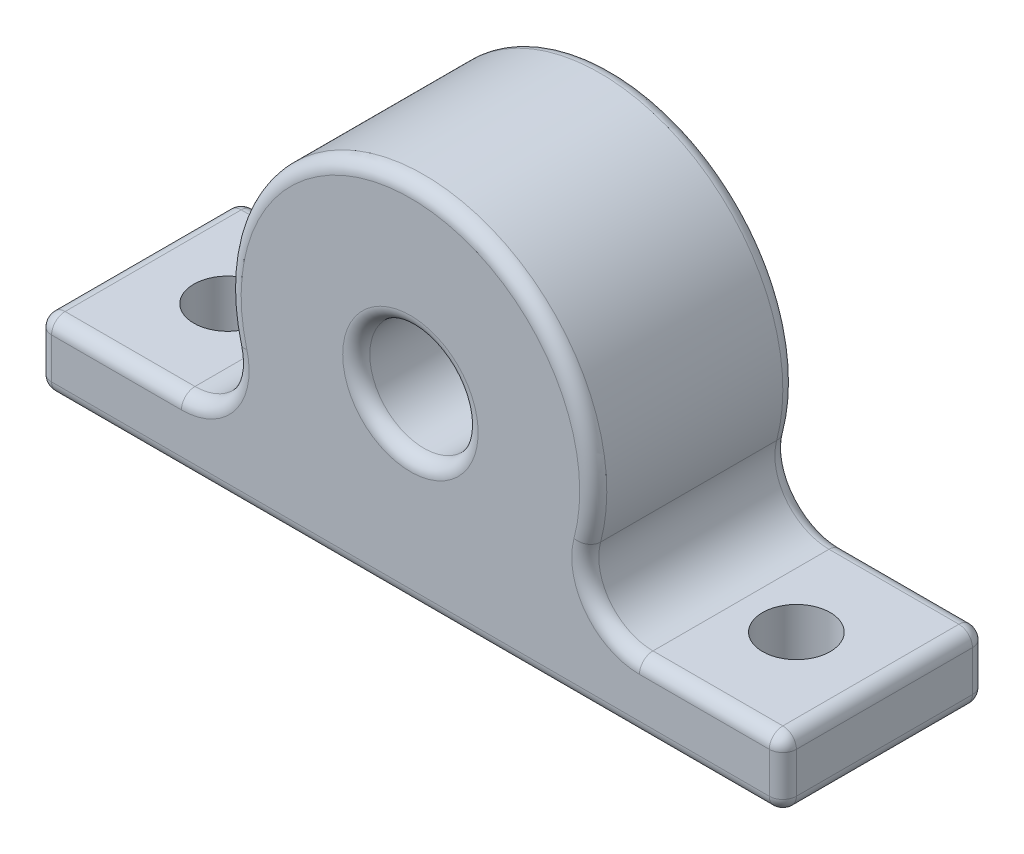
ISO-10303-21;
HEADER;
FILE_DESCRIPTION(('STEP AP214'),'2;1');
FILE_NAME('part.step','',(''),(''),'','','');
FILE_SCHEMA(('AUTOMOTIVE_DESIGN { 1 0 10303 214 1 1 1 1 }'));
ENDSEC;
DATA;
#1=APPLICATION_CONTEXT('core data for automotive mechanical design processes');
#2=APPLICATION_PROTOCOL_DEFINITION('international standard','automotive_design',2000,#1);
#3=PRODUCT_CONTEXT('',#1,'mechanical');
#4=PRODUCT('Part','Part','',(#3));
#5=PRODUCT_RELATED_PRODUCT_CATEGORY('part','',(#4));
#6=PRODUCT_DEFINITION_FORMATION('','',#4);
#7=PRODUCT_DEFINITION_CONTEXT('part definition',#1,'design');
#8=PRODUCT_DEFINITION('design','',#6,#7);
#9=PRODUCT_DEFINITION_SHAPE('','',#8);
#10=(LENGTH_UNIT() NAMED_UNIT(*) SI_UNIT(.MILLI.,.METRE.));
#11=(NAMED_UNIT(*) PLANE_ANGLE_UNIT() SI_UNIT($,.RADIAN.));
#12=(NAMED_UNIT(*) SI_UNIT($,.STERADIAN.) SOLID_ANGLE_UNIT());
#13=UNCERTAINTY_MEASURE_WITH_UNIT(LENGTH_MEASURE(1.E-05),#10,'distance_accuracy_value','');
#14=(GEOMETRIC_REPRESENTATION_CONTEXT(3) GLOBAL_UNCERTAINTY_ASSIGNED_CONTEXT((#13)) GLOBAL_UNIT_ASSIGNED_CONTEXT((#10,
#11,#12)) REPRESENTATION_CONTEXT('',''));
#15=CARTESIAN_POINT('',(0.,0.,0.));
#16=DIRECTION('',(0.,0.,1.));
#17=DIRECTION('',(1.,0.,0.));
#18=AXIS2_PLACEMENT_3D('',#15,#16,#17);
#19=CARTESIAN_POINT('',(0.,5.,0.));
#20=DIRECTION('',(0.,1.,0.));
#21=DIRECTION('',(0.,0.,1.));
#22=AXIS2_PLACEMENT_3D('',#19,#20,#21);
#23=PLANE('',#22);
#24=CARTESIAN_POINT('',(21.,5.,0.));
#25=DIRECTION('',(0.,1.,0.));
#26=DIRECTION('',(0.,0.,1.));
#27=AXIS2_PLACEMENT_3D('',#24,#25,#26);
#28=CIRCLE('',#27,2.5);
#29=CARTESIAN_POINT('',(21.,5.,2.5));
#30=VERTEX_POINT('',#29);
#31=EDGE_CURVE('E309',#30,#30,#28,.F.);
#32=ORIENTED_EDGE('',*,*,#31,.T.);
#33=EDGE_LOOP('',(#32));
#34=FACE_BOUND('',#33,.T.);
#35=DIRECTION('',(0.,0.,-1.));
#36=VECTOR('',#35,1.);
#37=CARTESIAN_POINT('',(26.5,5.,-7.5));
#38=LINE('',#37,#36);
#39=CARTESIAN_POINT('',(26.5,5.,6.5));
#40=VERTEX_POINT('',#39);
#41=CARTESIAN_POINT('',(26.5,5.,-6.5));
#42=VERTEX_POINT('',#41);
#43=EDGE_CURVE('E178',#40,#42,#38,.T.);
#44=ORIENTED_EDGE('',*,*,#43,.T.);
#45=DIRECTION('',(-1.,0.,0.));
#46=VECTOR('',#45,1.);
#47=CARTESIAN_POINT('',(16.9115345252878,5.,-6.5));
#48=LINE('',#47,#46);
#49=CARTESIAN_POINT('',(16.9115345252878,5.,-6.5));
#50=VERTEX_POINT('',#49);
#51=EDGE_CURVE('E173',#42,#50,#48,.T.);
#52=ORIENTED_EDGE('',*,*,#51,.T.);
#53=DIRECTION('',(0.,0.,-1.));
#54=VECTOR('',#53,1.);
#55=CARTESIAN_POINT('',(16.9115345252878,5.,0.));
#56=LINE('',#55,#54);
#57=CARTESIAN_POINT('',(16.9115345252878,5.,6.5));
#58=VERTEX_POINT('',#57);
#59=EDGE_CURVE('E175',#50,#58,#56,.F.);
#60=ORIENTED_EDGE('',*,*,#59,.T.);
#61=DIRECTION('',(1.,0.,0.));
#62=VECTOR('',#61,1.);
#63=CARTESIAN_POINT('',(27.5,5.,6.5));
#64=LINE('',#63,#62);
#65=EDGE_CURVE('E437',#58,#40,#64,.T.);
#66=ORIENTED_EDGE('',*,*,#65,.T.);
#67=EDGE_LOOP('',(#44,#52,#60,#66));
#68=FACE_BOUND('',#67,.T.);
#69=ADVANCED_FACE('F33',(#34,#68),#23,.T.);
#70=CARTESIAN_POINT('',(-21.,5.,0.));
#71=DIRECTION('',(0.,1.,0.));
#72=DIRECTION('',(0.,0.,1.));
#73=AXIS2_PLACEMENT_3D('',#70,#71,#72);
#74=CIRCLE('',#73,2.5);
#75=CARTESIAN_POINT('',(-21.,5.,2.5));
#76=VERTEX_POINT('',#75);
#77=EDGE_CURVE('E633',#76,#76,#74,.F.);
#78=ORIENTED_EDGE('',*,*,#77,.T.);
#79=EDGE_LOOP('',(#78));
#80=FACE_BOUND('',#79,.T.);
#81=DIRECTION('',(0.,0.,-1.));
#82=VECTOR('',#81,1.);
#83=CARTESIAN_POINT('',(-16.9115345252878,5.,0.));
#84=LINE('',#83,#82);
#85=CARTESIAN_POINT('',(-16.9115345252878,5.,6.5));
#86=VERTEX_POINT('',#85);
#87=CARTESIAN_POINT('',(-16.9115345252878,5.,-6.5));
#88=VERTEX_POINT('',#87);
#89=EDGE_CURVE('E427',#86,#88,#84,.T.);
#90=ORIENTED_EDGE('',*,*,#89,.T.);
#91=DIRECTION('',(-1.,0.,0.));
#92=VECTOR('',#91,1.);
#93=CARTESIAN_POINT('',(-27.5,5.,-6.5));
#94=LINE('',#93,#92);
#95=CARTESIAN_POINT('',(-26.5,5.,-6.5));
#96=VERTEX_POINT('',#95);
#97=EDGE_CURVE('E360',#88,#96,#94,.T.);
#98=ORIENTED_EDGE('',*,*,#97,.T.);
#99=DIRECTION('',(0.,0.,1.));
#100=VECTOR('',#99,1.);
#101=CARTESIAN_POINT('',(-26.5,5.,7.5));
#102=LINE('',#101,#100);
#103=CARTESIAN_POINT('',(-26.5,5.,6.5));
#104=VERTEX_POINT('',#103);
#105=EDGE_CURVE('E358',#96,#104,#102,.T.);
#106=ORIENTED_EDGE('',*,*,#105,.T.);
#107=DIRECTION('',(1.,0.,0.));
#108=VECTOR('',#107,1.);
#109=CARTESIAN_POINT('',(-16.9115345252878,5.,6.5));
#110=LINE('',#109,#108);
#111=EDGE_CURVE('E356',#104,#86,#110,.T.);
#112=ORIENTED_EDGE('',*,*,#111,.T.);
#113=EDGE_LOOP('',(#90,#98,#106,#112));
#114=FACE_BOUND('',#113,.T.);
#115=ADVANCED_FACE('F463',(#80,#114),#23,.T.);
#116=CARTESIAN_POINT('',(27.5,5.,-7.5));
#117=DIRECTION('',(-1.,0.,0.));
#118=DIRECTION('',(0.,0.,1.));
#119=AXIS2_PLACEMENT_3D('',#116,#117,#118);
#120=PLANE('',#119);
#121=DIRECTION('',(0.,0.,-1.));
#122=VECTOR('',#121,1.);
#123=CARTESIAN_POINT('',(27.5,1.,-7.5));
#124=LINE('',#123,#122);
#125=CARTESIAN_POINT('',(27.5,1.,6.5));
#126=VERTEX_POINT('',#125);
#127=CARTESIAN_POINT('',(27.5,1.,-6.5));
#128=VERTEX_POINT('',#127);
#129=EDGE_CURVE('E333',#126,#128,#124,.T.);
#130=ORIENTED_EDGE('',*,*,#129,.T.);
#131=DIRECTION('',(0.,-1.,0.));
#132=VECTOR('',#131,1.);
#133=CARTESIAN_POINT('',(27.5,5.,-6.5));
#134=LINE('',#133,#132);
#135=CARTESIAN_POINT('',(27.5,4.,-6.5));
#136=VERTEX_POINT('',#135);
#137=EDGE_CURVE('E339',#128,#136,#134,.F.);
#138=ORIENTED_EDGE('',*,*,#137,.T.);
#139=DIRECTION('',(0.,0.,-1.));
#140=VECTOR('',#139,1.);
#141=CARTESIAN_POINT('',(27.5,4.,7.5));
#142=LINE('',#141,#140);
#143=CARTESIAN_POINT('',(27.5,4.,6.5));
#144=VERTEX_POINT('',#143);
#145=EDGE_CURVE('E336',#136,#144,#142,.F.);
#146=ORIENTED_EDGE('',*,*,#145,.T.);
#147=DIRECTION('',(0.,-1.,0.));
#148=VECTOR('',#147,1.);
#149=CARTESIAN_POINT('',(27.5,5.,6.5));
#150=LINE('',#149,#148);
#151=EDGE_CURVE('E182',#144,#126,#150,.T.);
#152=ORIENTED_EDGE('',*,*,#151,.T.);
#153=EDGE_LOOP('',(#130,#138,#146,#152));
#154=FACE_BOUND('',#153,.T.);
#155=ADVANCED_FACE('F337',(#154),#120,.F.);
#156=CARTESIAN_POINT('',(-27.5,5.,-7.5));
#157=DIRECTION('',(0.,0.,1.));
#158=DIRECTION('',(1.,0.,0.));
#159=AXIS2_PLACEMENT_3D('',#156,#157,#158);
#160=PLANE('',#159);
#161=CARTESIAN_POINT('',(0.,13.5,-7.5));
#162=DIRECTION('',(0.,0.,1.));
#163=DIRECTION('',(1.,0.,0.));
#164=AXIS2_PLACEMENT_3D('',#161,#162,#163);
#165=CIRCLE('',#164,5.);
#166=CARTESIAN_POINT('',(5.,13.5,-7.5));
#167=VERTEX_POINT('',#166);
#168=EDGE_CURVE('E392',#167,#167,#165,.T.);
#169=ORIENTED_EDGE('',*,*,#168,.T.);
#170=EDGE_LOOP('',(#169));
#171=FACE_BOUND('',#170,.T.);
#172=DIRECTION('',(-1.,0.,0.));
#173=VECTOR('',#172,1.);
#174=CARTESIAN_POINT('',(-27.5,1.,-7.5));
#175=LINE('',#174,#173);
#176=CARTESIAN_POINT('',(26.5,1.,-7.5));
#177=VERTEX_POINT('',#176);
#178=CARTESIAN_POINT('',(-26.5,1.,-7.5));
#179=VERTEX_POINT('',#178);
#180=EDGE_CURVE('E387',#177,#179,#175,.T.);
#181=ORIENTED_EDGE('',*,*,#180,.T.);
#182=DIRECTION('',(0.,-1.,0.));
#183=VECTOR('',#182,1.);
#184=CARTESIAN_POINT('',(-26.5,5.,-7.5));
#185=LINE('',#184,#183);
#186=CARTESIAN_POINT('',(-26.5,4.,-7.5));
#187=VERTEX_POINT('',#186);
#188=EDGE_CURVE('E389',#179,#187,#185,.F.);
#189=ORIENTED_EDGE('',*,*,#188,.T.);
#190=DIRECTION('',(-1.,0.,0.));
#191=VECTOR('',#190,1.);
#192=CARTESIAN_POINT('',(-16.9115345252878,4.,-7.5));
#193=LINE('',#192,#191);
#194=CARTESIAN_POINT('',(-16.9115345252878,4.,-7.5));
#195=VERTEX_POINT('',#194);
#196=EDGE_CURVE('E376',#187,#195,#193,.F.);
#197=ORIENTED_EDGE('',*,*,#196,.T.);
#198=CARTESIAN_POINT('',(-16.9115345252878,9.,-7.5));
#199=DIRECTION('',(0.,0.,1.));
#200=DIRECTION('',(1.,0.,0.));
#201=AXIS2_PLACEMENT_3D('',#198,#199,#200);
#202=CIRCLE('',#201,5.);
#203=CARTESIAN_POINT('',(-12.0796675180627,10.2857142857143,-7.5));
#204=VERTEX_POINT('',#203);
#205=EDGE_CURVE('E378',#195,#204,#202,.T.);
#206=ORIENTED_EDGE('',*,*,#205,.T.);
#207=CARTESIAN_POINT('',(0.,13.5,-7.5));
#208=DIRECTION('',(0.,0.,1.));
#209=DIRECTION('',(1.,0.,0.));
#210=AXIS2_PLACEMENT_3D('',#207,#208,#209);
#211=CIRCLE('',#210,12.5);
#212=CARTESIAN_POINT('',(12.0796675180627,10.2857142857143,-7.5));
#213=VERTEX_POINT('',#212);
#214=EDGE_CURVE('E380',#204,#213,#211,.F.);
#215=ORIENTED_EDGE('',*,*,#214,.T.);
#216=CARTESIAN_POINT('',(16.9115345252878,9.,-7.5));
#217=DIRECTION('',(0.,0.,1.));
#218=DIRECTION('',(1.,0.,0.));
#219=AXIS2_PLACEMENT_3D('',#216,#217,#218);
#220=CIRCLE('',#219,5.);
#221=CARTESIAN_POINT('',(16.9115345252878,4.,-7.5));
#222=VERTEX_POINT('',#221);
#223=EDGE_CURVE('E382',#213,#222,#220,.T.);
#224=ORIENTED_EDGE('',*,*,#223,.T.);
#225=DIRECTION('',(-1.,0.,0.));
#226=VECTOR('',#225,1.);
#227=CARTESIAN_POINT('',(27.5,4.,-7.5));
#228=LINE('',#227,#226);
#229=CARTESIAN_POINT('',(26.5,4.,-7.5));
#230=VERTEX_POINT('',#229);
#231=EDGE_CURVE('E206',#222,#230,#228,.F.);
#232=ORIENTED_EDGE('',*,*,#231,.T.);
#233=DIRECTION('',(0.,-1.,0.));
#234=VECTOR('',#233,1.);
#235=CARTESIAN_POINT('',(26.5,5.,-7.5));
#236=LINE('',#235,#234);
#237=EDGE_CURVE('E385',#230,#177,#236,.T.);
#238=ORIENTED_EDGE('',*,*,#237,.T.);
#239=EDGE_LOOP('',(#181,#189,#197,#206,#215,#224,#232,#238));
#240=FACE_BOUND('',#239,.T.);
#241=ADVANCED_FACE('F485',(#171,#240),#160,.F.);
#242=CARTESIAN_POINT('',(-27.5,5.,-7.5));
#243=DIRECTION('',(1.,0.,0.));
#244=DIRECTION('',(0.,0.,-1.));
#245=AXIS2_PLACEMENT_3D('',#242,#243,#244);
#246=PLANE('',#245);
#247=DIRECTION('',(0.,0.,1.));
#248=VECTOR('',#247,1.);
#249=CARTESIAN_POINT('',(-27.5,4.,-7.5));
#250=LINE('',#249,#248);
#251=CARTESIAN_POINT('',(-27.5,4.,6.5));
#252=VERTEX_POINT('',#251);
#253=CARTESIAN_POINT('',(-27.5,4.,-6.5));
#254=VERTEX_POINT('',#253);
#255=EDGE_CURVE('E365',#252,#254,#250,.F.);
#256=ORIENTED_EDGE('',*,*,#255,.T.);
#257=DIRECTION('',(0.,-1.,0.));
#258=VECTOR('',#257,1.);
#259=CARTESIAN_POINT('',(-27.5,5.,-6.5));
#260=LINE('',#259,#258);
#261=CARTESIAN_POINT('',(-27.5,1.,-6.5));
#262=VERTEX_POINT('',#261);
#263=EDGE_CURVE('E368',#254,#262,#260,.T.);
#264=ORIENTED_EDGE('',*,*,#263,.T.);
#265=DIRECTION('',(0.,0.,1.));
#266=VECTOR('',#265,1.);
#267=CARTESIAN_POINT('',(-27.5,1.,-7.5));
#268=LINE('',#267,#266);
#269=CARTESIAN_POINT('',(-27.5,1.,6.5));
#270=VERTEX_POINT('',#269);
#271=EDGE_CURVE('E363',#262,#270,#268,.T.);
#272=ORIENTED_EDGE('',*,*,#271,.T.);
#273=DIRECTION('',(0.,-1.,0.));
#274=VECTOR('',#273,1.);
#275=CARTESIAN_POINT('',(-27.5,5.,6.5));
#276=LINE('',#275,#274);
#277=EDGE_CURVE('E295',#270,#252,#276,.F.);
#278=ORIENTED_EDGE('',*,*,#277,.T.);
#279=EDGE_LOOP('',(#256,#264,#272,#278));
#280=FACE_BOUND('',#279,.T.);
#281=ADVANCED_FACE('F481',(#280),#246,.F.);
#282=CARTESIAN_POINT('',(-27.5,5.,7.5));
#283=DIRECTION('',(0.,0.,-1.));
#284=DIRECTION('',(-1.,0.,0.));
#285=AXIS2_PLACEMENT_3D('',#282,#283,#284);
#286=PLANE('',#285);
#287=CARTESIAN_POINT('',(0.,13.5,7.5));
#288=DIRECTION('',(0.,0.,-1.));
#289=DIRECTION('',(-1.,0.,0.));
#290=AXIS2_PLACEMENT_3D('',#287,#288,#289);
#291=CIRCLE('',#290,5.);
#292=CARTESIAN_POINT('',(-5.,13.5,7.5));
#293=VERTEX_POINT('',#292);
#294=EDGE_CURVE('E11',#293,#293,#291,.T.);
#295=ORIENTED_EDGE('',*,*,#294,.T.);
#296=EDGE_LOOP('',(#295));
#297=FACE_BOUND('',#296,.T.);
#298=DIRECTION('',(1.,0.,0.));
#299=VECTOR('',#298,1.);
#300=CARTESIAN_POINT('',(-27.5,1.,7.5));
#301=LINE('',#300,#299);
#302=CARTESIAN_POINT('',(-26.5,1.,7.5));
#303=VERTEX_POINT('',#302);
#304=CARTESIAN_POINT('',(26.5,1.,7.5));
#305=VERTEX_POINT('',#304);
#306=EDGE_CURVE('E50',#303,#305,#301,.T.);
#307=ORIENTED_EDGE('',*,*,#306,.T.);
#308=DIRECTION('',(0.,-1.,0.));
#309=VECTOR('',#308,1.);
#310=CARTESIAN_POINT('',(26.5,5.,7.5));
#311=LINE('',#310,#309);
#312=CARTESIAN_POINT('',(26.5,4.,7.5));
#313=VERTEX_POINT('',#312);
#314=EDGE_CURVE('E42',#305,#313,#311,.F.);
#315=ORIENTED_EDGE('',*,*,#314,.T.);
#316=DIRECTION('',(1.,0.,0.));
#317=VECTOR('',#316,1.);
#318=CARTESIAN_POINT('',(16.9115345252878,4.,7.5));
#319=LINE('',#318,#317);
#320=CARTESIAN_POINT('',(16.9115345252878,4.,7.5));
#321=VERTEX_POINT('',#320);
#322=EDGE_CURVE('E403',#313,#321,#319,.F.);
#323=ORIENTED_EDGE('',*,*,#322,.T.);
#324=CARTESIAN_POINT('',(16.9115345252878,9.,7.5));
#325=DIRECTION('',(0.,0.,-1.));
#326=DIRECTION('',(-1.,0.,0.));
#327=AXIS2_PLACEMENT_3D('',#324,#325,#326);
#328=CIRCLE('',#327,5.);
#329=CARTESIAN_POINT('',(12.0796675180627,10.2857142857143,7.5));
#330=VERTEX_POINT('',#329);
#331=EDGE_CURVE('E405',#321,#330,#328,.T.);
#332=ORIENTED_EDGE('',*,*,#331,.T.);
#333=CARTESIAN_POINT('',(0.,13.5,7.5));
#334=DIRECTION('',(0.,0.,-1.));
#335=DIRECTION('',(-1.,0.,0.));
#336=AXIS2_PLACEMENT_3D('',#333,#334,#335);
#337=CIRCLE('',#336,12.5);
#338=CARTESIAN_POINT('',(-12.0796675180627,10.2857142857143,7.5));
#339=VERTEX_POINT('',#338);
#340=EDGE_CURVE('E407',#330,#339,#337,.F.);
#341=ORIENTED_EDGE('',*,*,#340,.T.);
#342=CARTESIAN_POINT('',(-16.9115345252878,9.,7.5));
#343=DIRECTION('',(0.,0.,-1.));
#344=DIRECTION('',(-1.,0.,0.));
#345=AXIS2_PLACEMENT_3D('',#342,#343,#344);
#346=CIRCLE('',#345,5.);
#347=CARTESIAN_POINT('',(-16.9115345252878,4.,7.5));
#348=VERTEX_POINT('',#347);
#349=EDGE_CURVE('E301',#339,#348,#346,.T.);
#350=ORIENTED_EDGE('',*,*,#349,.T.);
#351=DIRECTION('',(1.,0.,0.));
#352=VECTOR('',#351,1.);
#353=CARTESIAN_POINT('',(-27.5,4.,7.5));
#354=LINE('',#353,#352);
#355=CARTESIAN_POINT('',(-26.5,4.,7.5));
#356=VERTEX_POINT('',#355);
#357=EDGE_CURVE('E298',#348,#356,#354,.F.);
#358=ORIENTED_EDGE('',*,*,#357,.T.);
#359=DIRECTION('',(0.,-1.,0.));
#360=VECTOR('',#359,1.);
#361=CARTESIAN_POINT('',(-26.5,5.,7.5));
#362=LINE('',#361,#360);
#363=EDGE_CURVE('E55',#356,#303,#362,.T.);
#364=ORIENTED_EDGE('',*,*,#363,.T.);
#365=EDGE_LOOP('',(#307,#315,#323,#332,#341,#350,#358,#364));
#366=FACE_BOUND('',#365,.T.);
#367=ADVANCED_FACE('F410',(#297,#366),#286,.F.);
#368=CARTESIAN_POINT('',(0.,0.,0.));
#369=DIRECTION('',(0.,1.,0.));
#370=DIRECTION('',(0.,0.,1.));
#371=AXIS2_PLACEMENT_3D('',#368,#369,#370);
#372=PLANE('',#371);
#373=CARTESIAN_POINT('',(21.,0.,0.));
#374=DIRECTION('',(0.,1.,0.));
#375=DIRECTION('',(0.,0.,1.));
#376=AXIS2_PLACEMENT_3D('',#373,#374,#375);
#377=CIRCLE('',#376,2.5);
#378=CARTESIAN_POINT('',(21.,0.,2.5));
#379=VERTEX_POINT('',#378);
#380=EDGE_CURVE('E632',#379,#379,#377,.T.);
#381=ORIENTED_EDGE('',*,*,#380,.T.);
#382=EDGE_LOOP('',(#381));
#383=FACE_BOUND('',#382,.T.);
#384=CARTESIAN_POINT('',(-21.,0.,0.));
#385=DIRECTION('',(0.,1.,0.));
#386=DIRECTION('',(0.,0.,-1.));
#387=AXIS2_PLACEMENT_3D('',#384,#385,#386);
#388=CIRCLE('',#387,2.5);
#389=CARTESIAN_POINT('',(-21.,0.,-2.5));
#390=VERTEX_POINT('',#389);
#391=EDGE_CURVE('E634',#390,#390,#388,.T.);
#392=ORIENTED_EDGE('',*,*,#391,.T.);
#393=EDGE_LOOP('',(#392));
#394=FACE_BOUND('',#393,.T.);
#395=DIRECTION('',(0.,0.,1.));
#396=VECTOR('',#395,1.);
#397=CARTESIAN_POINT('',(-26.5,0.,0.));
#398=LINE('',#397,#396);
#399=CARTESIAN_POINT('',(-26.5,0.,6.5));
#400=VERTEX_POINT('',#399);
#401=CARTESIAN_POINT('',(-26.5,0.,-6.5));
#402=VERTEX_POINT('',#401);
#403=EDGE_CURVE('E349',#400,#402,#398,.F.);
#404=ORIENTED_EDGE('',*,*,#403,.T.);
#405=DIRECTION('',(-1.,0.,0.));
#406=VECTOR('',#405,1.);
#407=CARTESIAN_POINT('',(0.,0.,-6.5));
#408=LINE('',#407,#406);
#409=CARTESIAN_POINT('',(26.5,0.,-6.5));
#410=VERTEX_POINT('',#409);
#411=EDGE_CURVE('E354',#402,#410,#408,.F.);
#412=ORIENTED_EDGE('',*,*,#411,.T.);
#413=DIRECTION('',(0.,0.,-1.));
#414=VECTOR('',#413,1.);
#415=CARTESIAN_POINT('',(26.5,0.,0.));
#416=LINE('',#415,#414);
#417=CARTESIAN_POINT('',(26.5,0.,6.5));
#418=VERTEX_POINT('',#417);
#419=EDGE_CURVE('E351',#410,#418,#416,.F.);
#420=ORIENTED_EDGE('',*,*,#419,.T.);
#421=DIRECTION('',(1.,0.,0.));
#422=VECTOR('',#421,1.);
#423=CARTESIAN_POINT('',(0.,0.,6.5));
#424=LINE('',#423,#422);
#425=EDGE_CURVE('E344',#418,#400,#424,.F.);
#426=ORIENTED_EDGE('',*,*,#425,.T.);
#427=EDGE_LOOP('',(#404,#412,#420,#426));
#428=FACE_BOUND('',#427,.T.);
#429=ADVANCED_FACE('F475',(#383,#394,#428),#372,.F.);
#430=CARTESIAN_POINT('',(0.,13.5,45.6837661840736));
#431=DIRECTION('',(0.,0.,-1.));
#432=DIRECTION('',(-1.,0.,0.));
#433=AXIS2_PLACEMENT_3D('',#430,#431,#432);
#434=CYLINDRICAL_SURFACE('',#433,13.5);
#435=DIRECTION('',(0.,0.,-1.));
#436=VECTOR('',#435,1.);
#437=CARTESIAN_POINT('',(13.0460409195077,10.0285714285714,45.6837661840736));
#438=LINE('',#437,#436);
#439=CARTESIAN_POINT('',(13.0460409195077,10.0285714285714,6.5));
#440=VERTEX_POINT('',#439);
#441=CARTESIAN_POINT('',(13.0460409195077,10.0285714285714,-6.5));
#442=VERTEX_POINT('',#441);
#443=EDGE_CURVE('E431',#440,#442,#438,.T.);
#444=ORIENTED_EDGE('',*,*,#443,.T.);
#445=CARTESIAN_POINT('',(0.,13.5,-6.5));
#446=DIRECTION('',(0.,0.,1.));
#447=DIRECTION('',(1.,0.,0.));
#448=AXIS2_PLACEMENT_3D('',#445,#446,#447);
#449=CIRCLE('',#448,13.5);
#450=CARTESIAN_POINT('',(-13.0460409195077,10.0285714285714,-6.5));
#451=VERTEX_POINT('',#450);
#452=EDGE_CURVE('E397',#442,#451,#449,.T.);
#453=ORIENTED_EDGE('',*,*,#452,.T.);
#454=DIRECTION('',(0.,0.,-1.));
#455=VECTOR('',#454,1.);
#456=CARTESIAN_POINT('',(-13.0460409195077,10.0285714285714,45.6837661840736));
#457=LINE('',#456,#455);
#458=CARTESIAN_POINT('',(-13.0460409195077,10.0285714285714,6.5));
#459=VERTEX_POINT('',#458);
#460=EDGE_CURVE('E192',#451,#459,#457,.F.);
#461=ORIENTED_EDGE('',*,*,#460,.T.);
#462=CARTESIAN_POINT('',(0.,13.5,6.5));
#463=DIRECTION('',(0.,0.,-1.));
#464=DIRECTION('',(-1.,0.,0.));
#465=AXIS2_PLACEMENT_3D('',#462,#463,#464);
#466=CIRCLE('',#465,13.5);
#467=EDGE_CURVE('E203',#459,#440,#466,.T.);
#468=ORIENTED_EDGE('',*,*,#467,.T.);
#469=EDGE_LOOP('',(#444,#453,#461,#468));
#470=FACE_BOUND('',#469,.T.);
#471=ADVANCED_FACE('F429',(#470),#434,.T.);
#472=CARTESIAN_POINT('',(0.,13.5,45.6837661840736));
#473=DIRECTION('',(0.,0.,-1.));
#474=DIRECTION('',(-1.,0.,0.));
#475=AXIS2_PLACEMENT_3D('',#472,#473,#474);
#476=CYLINDRICAL_SURFACE('',#475,4.);
#477=CARTESIAN_POINT('',(0.,13.5,-6.5));
#478=DIRECTION('',(0.,0.,1.));
#479=DIRECTION('',(1.,0.,0.));
#480=AXIS2_PLACEMENT_3D('',#477,#478,#479);
#481=CIRCLE('',#480,4.);
#482=CARTESIAN_POINT('',(4.,13.5,-6.5));
#483=VERTEX_POINT('',#482);
#484=EDGE_CURVE('E373',#483,#483,#481,.F.);
#485=ORIENTED_EDGE('',*,*,#484,.T.);
#486=EDGE_LOOP('',(#485));
#487=FACE_BOUND('',#486,.T.);
#488=CARTESIAN_POINT('',(0.,13.5,6.5));
#489=DIRECTION('',(0.,0.,-1.));
#490=DIRECTION('',(-1.,0.,0.));
#491=AXIS2_PLACEMENT_3D('',#488,#489,#490);
#492=CIRCLE('',#491,4.);
#493=CARTESIAN_POINT('',(-4.,13.5,6.5));
#494=VERTEX_POINT('',#493);
#495=EDGE_CURVE('E370',#494,#494,#492,.F.);
#496=ORIENTED_EDGE('',*,*,#495,.T.);
#497=EDGE_LOOP('',(#496));
#498=FACE_BOUND('',#497,.T.);
#499=ADVANCED_FACE('F473',(#487,#498),#476,.F.);
#500=CARTESIAN_POINT('',(16.9115345252878,9.,45.6837661840736));
#501=DIRECTION('',(0.,0.,-1.));
#502=DIRECTION('',(-1.,0.,0.));
#503=AXIS2_PLACEMENT_3D('',#500,#501,#502);
#504=CYLINDRICAL_SURFACE('',#503,4.);
#505=ORIENTED_EDGE('',*,*,#59,.F.);
#506=CARTESIAN_POINT('',(16.9115345252878,9.,-6.5));
#507=DIRECTION('',(0.,0.,1.));
#508=DIRECTION('',(1.,0.,0.));
#509=AXIS2_PLACEMENT_3D('',#506,#507,#508);
#510=CIRCLE('',#509,4.);
#511=EDGE_CURVE('E188',#50,#442,#510,.F.);
#512=ORIENTED_EDGE('',*,*,#511,.T.);
#513=ORIENTED_EDGE('',*,*,#443,.F.);
#514=CARTESIAN_POINT('',(16.9115345252878,9.,6.5));
#515=DIRECTION('',(0.,0.,-1.));
#516=DIRECTION('',(-1.,0.,0.));
#517=AXIS2_PLACEMENT_3D('',#514,#515,#516);
#518=CIRCLE('',#517,4.);
#519=EDGE_CURVE('E191',#440,#58,#518,.F.);
#520=ORIENTED_EDGE('',*,*,#519,.T.);
#521=EDGE_LOOP('',(#505,#512,#513,#520));
#522=FACE_BOUND('',#521,.T.);
#523=ADVANCED_FACE('F186',(#522),#504,.F.);
#524=CARTESIAN_POINT('',(-16.9115345252878,9.,45.6837661840736));
#525=DIRECTION('',(0.,0.,-1.));
#526=DIRECTION('',(-1.,0.,0.));
#527=AXIS2_PLACEMENT_3D('',#524,#525,#526);
#528=CYLINDRICAL_SURFACE('',#527,4.);
#529=ORIENTED_EDGE('',*,*,#460,.F.);
#530=CARTESIAN_POINT('',(-16.9115345252878,9.,-6.5));
#531=DIRECTION('',(0.,0.,1.));
#532=DIRECTION('',(1.,0.,0.));
#533=AXIS2_PLACEMENT_3D('',#530,#531,#532);
#534=CIRCLE('',#533,4.);
#535=EDGE_CURVE('E401',#451,#88,#534,.F.);
#536=ORIENTED_EDGE('',*,*,#535,.T.);
#537=ORIENTED_EDGE('',*,*,#89,.F.);
#538=CARTESIAN_POINT('',(-16.9115345252878,9.,6.5));
#539=DIRECTION('',(0.,0.,-1.));
#540=DIRECTION('',(-1.,0.,0.));
#541=AXIS2_PLACEMENT_3D('',#538,#539,#540);
#542=CIRCLE('',#541,4.);
#543=EDGE_CURVE('E399',#86,#459,#542,.F.);
#544=ORIENTED_EDGE('',*,*,#543,.T.);
#545=EDGE_LOOP('',(#529,#536,#537,#544));
#546=FACE_BOUND('',#545,.T.);
#547=ADVANCED_FACE('F424',(#546),#528,.F.);
#548=CARTESIAN_POINT('',(-26.5,4.,0.));
#549=DIRECTION('',(0.,0.,-1.));
#550=DIRECTION('',(-1.,0.,0.));
#551=AXIS2_PLACEMENT_3D('',#548,#549,#550);
#552=CYLINDRICAL_SURFACE('',#551,1.);
#553=CARTESIAN_POINT('',(-26.5,4.,6.5));
#554=DIRECTION('',(0.,0.,1.));
#555=DIRECTION('',(1.,0.,0.));
#556=AXIS2_PLACEMENT_3D('',#553,#554,#555);
#557=CIRCLE('',#556,1.);
#558=EDGE_CURVE('E37',#104,#252,#557,.T.);
#559=ORIENTED_EDGE('',*,*,#558,.F.);
#560=ORIENTED_EDGE('',*,*,#105,.F.);
#561=CARTESIAN_POINT('',(-26.5,4.,-6.5));
#562=DIRECTION('',(0.,0.,-1.));
#563=DIRECTION('',(-1.,0.,0.));
#564=AXIS2_PLACEMENT_3D('',#561,#562,#563);
#565=CIRCLE('',#564,1.);
#566=EDGE_CURVE('E276',#254,#96,#565,.T.);
#567=ORIENTED_EDGE('',*,*,#566,.F.);
#568=ORIENTED_EDGE('',*,*,#255,.F.);
#569=EDGE_LOOP('',(#559,#560,#567,#568));
#570=FACE_BOUND('',#569,.T.);
#571=ADVANCED_FACE('F496',(#570),#552,.T.);
#572=CARTESIAN_POINT('',(-26.5,4.,6.5));
#573=DIRECTION('',(-1.,0.,0.));
#574=DIRECTION('',(0.,0.,1.));
#575=AXIS2_PLACEMENT_3D('',#572,#573,#574);
#576=SPHERICAL_SURFACE('',#575,1.);
#577=CARTESIAN_POINT('',(-26.5,4.,6.5));
#578=DIRECTION('',(-1.,0.,0.));
#579=DIRECTION('',(0.,-1.,0.));
#580=AXIS2_PLACEMENT_3D('',#577,#578,#579);
#581=CIRCLE('',#580,1.);
#582=EDGE_CURVE('E271',#104,#356,#581,.F.);
#583=ORIENTED_EDGE('',*,*,#582,.F.);
#584=ORIENTED_EDGE('',*,*,#558,.T.);
#585=CARTESIAN_POINT('',(-26.5,4.,6.5));
#586=DIRECTION('',(0.,1.,0.));
#587=DIRECTION('',(0.,0.,1.));
#588=AXIS2_PLACEMENT_3D('',#585,#586,#587);
#589=CIRCLE('',#588,1.);
#590=EDGE_CURVE('E274',#356,#252,#589,.F.);
#591=ORIENTED_EDGE('',*,*,#590,.F.);
#592=EDGE_LOOP('',(#583,#584,#591));
#593=FACE_BOUND('',#592,.T.);
#594=ADVANCED_FACE('F287',(#593),#576,.T.);
#595=CARTESIAN_POINT('',(-26.5,4.,-6.5));
#596=DIRECTION('',(0.,1.,0.));
#597=DIRECTION('',(-1.,0.,0.));
#598=AXIS2_PLACEMENT_3D('',#595,#596,#597);
#599=SPHERICAL_SURFACE('',#598,1.);
#600=CARTESIAN_POINT('',(-26.5,4.,-6.5));
#601=DIRECTION('',(0.,1.,0.));
#602=DIRECTION('',(0.,0.,1.));
#603=AXIS2_PLACEMENT_3D('',#600,#601,#602);
#604=CIRCLE('',#603,1.);
#605=EDGE_CURVE('E265',#254,#187,#604,.F.);
#606=ORIENTED_EDGE('',*,*,#605,.F.);
#607=ORIENTED_EDGE('',*,*,#566,.T.);
#608=CARTESIAN_POINT('',(-26.5,4.,-6.5));
#609=DIRECTION('',(-1.,0.,0.));
#610=DIRECTION('',(0.,0.,1.));
#611=AXIS2_PLACEMENT_3D('',#608,#609,#610);
#612=CIRCLE('',#611,1.);
#613=EDGE_CURVE('E268',#187,#96,#612,.F.);
#614=ORIENTED_EDGE('',*,*,#613,.F.);
#615=EDGE_LOOP('',(#606,#607,#614));
#616=FACE_BOUND('',#615,.T.);
#617=ADVANCED_FACE('F592',(#616),#599,.T.);
#618=CARTESIAN_POINT('',(-26.5,5.,6.5));
#619=DIRECTION('',(0.,-1.,0.));
#620=DIRECTION('',(0.,0.,-1.));
#621=AXIS2_PLACEMENT_3D('',#618,#619,#620);
#622=CYLINDRICAL_SURFACE('',#621,1.);
#623=ORIENTED_EDGE('',*,*,#590,.T.);
#624=ORIENTED_EDGE('',*,*,#277,.F.);
#625=CARTESIAN_POINT('',(-26.5,1.,6.5));
#626=DIRECTION('',(0.,-1.,0.));
#627=DIRECTION('',(0.,0.,-1.));
#628=AXIS2_PLACEMENT_3D('',#625,#626,#627);
#629=CIRCLE('',#628,1.);
#630=EDGE_CURVE('E259',#303,#270,#629,.T.);
#631=ORIENTED_EDGE('',*,*,#630,.F.);
#632=ORIENTED_EDGE('',*,*,#363,.F.);
#633=EDGE_LOOP('',(#623,#624,#631,#632));
#634=FACE_BOUND('',#633,.T.);
#635=ADVANCED_FACE('F294',(#634),#622,.T.);
#636=CARTESIAN_POINT('',(0.,4.,6.5));
#637=DIRECTION('',(-1.,0.,0.));
#638=DIRECTION('',(0.,0.,1.));
#639=AXIS2_PLACEMENT_3D('',#636,#637,#638);
#640=CYLINDRICAL_SURFACE('',#639,1.);
#641=ORIENTED_EDGE('',*,*,#582,.T.);
#642=ORIENTED_EDGE('',*,*,#357,.F.);
#643=CARTESIAN_POINT('',(-16.9115345252878,4.,6.5));
#644=DIRECTION('',(1.,0.,0.));
#645=DIRECTION('',(0.,0.,-1.));
#646=AXIS2_PLACEMENT_3D('',#643,#644,#645);
#647=CIRCLE('',#646,1.);
#648=EDGE_CURVE('E256',#86,#348,#647,.T.);
#649=ORIENTED_EDGE('',*,*,#648,.F.);
#650=ORIENTED_EDGE('',*,*,#111,.F.);
#651=EDGE_LOOP('',(#641,#642,#649,#650));
#652=FACE_BOUND('',#651,.T.);
#653=ADVANCED_FACE('F416',(#652),#640,.T.);
#654=CARTESIAN_POINT('',(0.,4.,-6.5));
#655=DIRECTION('',(1.,0.,0.));
#656=DIRECTION('',(0.,0.,-1.));
#657=AXIS2_PLACEMENT_3D('',#654,#655,#656);
#658=CYLINDRICAL_SURFACE('',#657,1.);
#659=ORIENTED_EDGE('',*,*,#613,.T.);
#660=ORIENTED_EDGE('',*,*,#97,.F.);
#661=CARTESIAN_POINT('',(-16.9115345252878,4.,-6.5));
#662=DIRECTION('',(1.,0.,0.));
#663=DIRECTION('',(0.,0.,-1.));
#664=AXIS2_PLACEMENT_3D('',#661,#662,#663);
#665=CIRCLE('',#664,1.);
#666=EDGE_CURVE('E253',#195,#88,#665,.T.);
#667=ORIENTED_EDGE('',*,*,#666,.F.);
#668=ORIENTED_EDGE('',*,*,#196,.F.);
#669=EDGE_LOOP('',(#659,#660,#667,#668));
#670=FACE_BOUND('',#669,.T.);
#671=ADVANCED_FACE('F563',(#670),#658,.T.);
#672=CARTESIAN_POINT('',(-26.5,5.,-6.5));
#673=DIRECTION('',(0.,-1.,0.));
#674=DIRECTION('',(0.,0.,-1.));
#675=AXIS2_PLACEMENT_3D('',#672,#673,#674);
#676=CYLINDRICAL_SURFACE('',#675,1.);
#677=ORIENTED_EDGE('',*,*,#605,.T.);
#678=ORIENTED_EDGE('',*,*,#188,.F.);
#679=CARTESIAN_POINT('',(-26.5,1.,-6.5));
#680=DIRECTION('',(0.,-1.,0.));
#681=DIRECTION('',(0.,0.,-1.));
#682=AXIS2_PLACEMENT_3D('',#679,#680,#681);
#683=CIRCLE('',#682,1.);
#684=EDGE_CURVE('E250',#262,#179,#683,.T.);
#685=ORIENTED_EDGE('',*,*,#684,.F.);
#686=ORIENTED_EDGE('',*,*,#263,.F.);
#687=EDGE_LOOP('',(#677,#678,#685,#686));
#688=FACE_BOUND('',#687,.T.);
#689=ADVANCED_FACE('F546',(#688),#676,.T.);
#690=CARTESIAN_POINT('',(-26.5,1.,-7.5));
#691=DIRECTION('',(0.,0.,1.));
#692=DIRECTION('',(1.,0.,0.));
#693=AXIS2_PLACEMENT_3D('',#690,#691,#692);
#694=CYLINDRICAL_SURFACE('',#693,1.);
#695=CARTESIAN_POINT('',(-26.5,1.,6.5));
#696=DIRECTION('',(0.,0.,1.));
#697=DIRECTION('',(1.,0.,0.));
#698=AXIS2_PLACEMENT_3D('',#695,#696,#697);
#699=CIRCLE('',#698,1.);
#700=EDGE_CURVE('E262',#270,#400,#699,.T.);
#701=ORIENTED_EDGE('',*,*,#700,.F.);
#702=ORIENTED_EDGE('',*,*,#271,.F.);
#703=CARTESIAN_POINT('',(-26.5,1.,-6.5));
#704=DIRECTION('',(0.,0.,-1.));
#705=DIRECTION('',(-1.,0.,0.));
#706=AXIS2_PLACEMENT_3D('',#703,#704,#705);
#707=CIRCLE('',#706,1.);
#708=EDGE_CURVE('E247',#402,#262,#707,.T.);
#709=ORIENTED_EDGE('',*,*,#708,.F.);
#710=ORIENTED_EDGE('',*,*,#403,.F.);
#711=EDGE_LOOP('',(#701,#702,#709,#710));
#712=FACE_BOUND('',#711,.T.);
#713=ADVANCED_FACE('F559',(#712),#694,.T.);
#714=CARTESIAN_POINT('',(-26.5,1.,6.5));
#715=DIRECTION('',(-1.,0.,0.));
#716=DIRECTION('',(0.,0.,1.));
#717=AXIS2_PLACEMENT_3D('',#714,#715,#716);
#718=SPHERICAL_SURFACE('',#717,1.);
#719=ORIENTED_EDGE('',*,*,#630,.T.);
#720=ORIENTED_EDGE('',*,*,#700,.T.);
#721=CARTESIAN_POINT('',(-26.5,1.,6.5));
#722=DIRECTION('',(-1.,0.,0.));
#723=DIRECTION('',(0.,0.,1.));
#724=AXIS2_PLACEMENT_3D('',#721,#722,#723);
#725=CIRCLE('',#724,1.);
#726=EDGE_CURVE('E244',#303,#400,#725,.F.);
#727=ORIENTED_EDGE('',*,*,#726,.F.);
#728=EDGE_LOOP('',(#719,#720,#727));
#729=FACE_BOUND('',#728,.T.);
#730=ADVANCED_FACE('F576',(#729),#718,.T.);
#731=CARTESIAN_POINT('',(-16.9115345252878,9.,6.5));
#732=DIRECTION('',(0.,0.,-1.));
#733=DIRECTION('',(-1.,0.,0.));
#734=AXIS2_PLACEMENT_3D('',#731,#732,#733);
#735=TOROIDAL_SURFACE('',#734,5.,1.);
#736=ORIENTED_EDGE('',*,*,#648,.T.);
#737=ORIENTED_EDGE('',*,*,#349,.F.);
#738=CARTESIAN_POINT('',(-12.0796675180627,10.2857142857143,6.5));
#739=DIRECTION('',(-0.257142857142857,0.966373401445015,0.));
#740=DIRECTION('',(-0.966373401445015,-0.257142857142857,0.));
#741=AXIS2_PLACEMENT_3D('',#738,#739,#740);
#742=CIRCLE('',#741,1.);
#743=EDGE_CURVE('E241',#459,#339,#742,.T.);
#744=ORIENTED_EDGE('',*,*,#743,.F.);
#745=ORIENTED_EDGE('',*,*,#543,.F.);
#746=EDGE_LOOP('',(#736,#737,#744,#745));
#747=FACE_BOUND('',#746,.T.);
#748=ADVANCED_FACE('F418',(#747),#735,.T.);
#749=CARTESIAN_POINT('',(-16.9115345252878,9.,-6.5));
#750=DIRECTION('',(0.,0.,1.));
#751=DIRECTION('',(1.,0.,0.));
#752=AXIS2_PLACEMENT_3D('',#749,#750,#751);
#753=TOROIDAL_SURFACE('',#752,5.,1.);
#754=ORIENTED_EDGE('',*,*,#666,.T.);
#755=ORIENTED_EDGE('',*,*,#535,.F.);
#756=CARTESIAN_POINT('',(-12.0796675180627,10.2857142857143,-6.5));
#757=DIRECTION('',(-0.257142857142857,0.966373401445015,0.));
#758=DIRECTION('',(-0.966373401445015,-0.257142857142857,0.));
#759=AXIS2_PLACEMENT_3D('',#756,#757,#758);
#760=CIRCLE('',#759,1.);
#761=EDGE_CURVE('E238',#204,#451,#760,.T.);
#762=ORIENTED_EDGE('',*,*,#761,.F.);
#763=ORIENTED_EDGE('',*,*,#205,.F.);
#764=EDGE_LOOP('',(#754,#755,#762,#763));
#765=FACE_BOUND('',#764,.T.);
#766=ADVANCED_FACE('F566',(#765),#753,.T.);
#767=CARTESIAN_POINT('',(-26.5,1.,-6.5));
#768=DIRECTION('',(-1.,0.,0.));
#769=DIRECTION('',(0.,0.,1.));
#770=AXIS2_PLACEMENT_3D('',#767,#768,#769);
#771=SPHERICAL_SURFACE('',#770,1.);
#772=ORIENTED_EDGE('',*,*,#708,.T.);
#773=ORIENTED_EDGE('',*,*,#684,.T.);
#774=CARTESIAN_POINT('',(-26.5,1.,-6.5));
#775=DIRECTION('',(-1.,0.,0.));
#776=DIRECTION('',(0.,0.,1.));
#777=AXIS2_PLACEMENT_3D('',#774,#775,#776);
#778=CIRCLE('',#777,1.);
#779=EDGE_CURVE('E235',#402,#179,#778,.F.);
#780=ORIENTED_EDGE('',*,*,#779,.F.);
#781=EDGE_LOOP('',(#772,#773,#780));
#782=FACE_BOUND('',#781,.T.);
#783=ADVANCED_FACE('F459',(#782),#771,.T.);
#784=CARTESIAN_POINT('',(-27.5,1.,6.5));
#785=DIRECTION('',(1.,0.,0.));
#786=DIRECTION('',(0.,0.,-1.));
#787=AXIS2_PLACEMENT_3D('',#784,#785,#786);
#788=CYLINDRICAL_SURFACE('',#787,1.);
#789=ORIENTED_EDGE('',*,*,#726,.T.);
#790=ORIENTED_EDGE('',*,*,#425,.F.);
#791=CARTESIAN_POINT('',(26.5,1.,6.5));
#792=DIRECTION('',(1.,0.,0.));
#793=DIRECTION('',(0.,0.,-1.));
#794=AXIS2_PLACEMENT_3D('',#791,#792,#793);
#795=CIRCLE('',#794,1.);
#796=EDGE_CURVE('E230',#305,#418,#795,.T.);
#797=ORIENTED_EDGE('',*,*,#796,.F.);
#798=ORIENTED_EDGE('',*,*,#306,.F.);
#799=EDGE_LOOP('',(#789,#790,#797,#798));
#800=FACE_BOUND('',#799,.T.);
#801=ADVANCED_FACE('F450',(#800),#788,.T.);
#802=CARTESIAN_POINT('',(0.,13.5,6.5));
#803=DIRECTION('',(0.,0.,-1.));
#804=DIRECTION('',(-1.,0.,0.));
#805=AXIS2_PLACEMENT_3D('',#802,#803,#804);
#806=TOROIDAL_SURFACE('',#805,12.5,1.);
#807=ORIENTED_EDGE('',*,*,#743,.T.);
#808=ORIENTED_EDGE('',*,*,#340,.F.);
#809=CARTESIAN_POINT('',(12.0796675180627,10.2857142857143,6.5));
#810=DIRECTION('',(-0.257142857142857,-0.966373401445015,0.));
#811=DIRECTION('',(0.966373401445015,-0.257142857142857,0.));
#812=AXIS2_PLACEMENT_3D('',#809,#810,#811);
#813=CIRCLE('',#812,1.);
#814=EDGE_CURVE('E227',#440,#330,#813,.T.);
#815=ORIENTED_EDGE('',*,*,#814,.F.);
#816=ORIENTED_EDGE('',*,*,#467,.F.);
#817=EDGE_LOOP('',(#807,#808,#815,#816));
#818=FACE_BOUND('',#817,.T.);
#819=ADVANCED_FACE('F447',(#818),#806,.T.);
#820=CARTESIAN_POINT('',(0.,13.5,-6.5));
#821=DIRECTION('',(0.,0.,1.));
#822=DIRECTION('',(1.,0.,0.));
#823=AXIS2_PLACEMENT_3D('',#820,#821,#822);
#824=TOROIDAL_SURFACE('',#823,12.5,1.);
#825=ORIENTED_EDGE('',*,*,#761,.T.);
#826=ORIENTED_EDGE('',*,*,#452,.F.);
#827=CARTESIAN_POINT('',(12.0796675180627,10.2857142857143,-6.5));
#828=DIRECTION('',(-0.257142857142857,-0.966373401445015,0.));
#829=DIRECTION('',(0.966373401445015,-0.257142857142857,0.));
#830=AXIS2_PLACEMENT_3D('',#827,#828,#829);
#831=CIRCLE('',#830,1.);
#832=EDGE_CURVE('E202',#213,#442,#831,.T.);
#833=ORIENTED_EDGE('',*,*,#832,.F.);
#834=ORIENTED_EDGE('',*,*,#214,.F.);
#835=EDGE_LOOP('',(#825,#826,#833,#834));
#836=FACE_BOUND('',#835,.T.);
#837=ADVANCED_FACE('F449',(#836),#824,.T.);
#838=CARTESIAN_POINT('',(-27.5,1.,-6.5));
#839=DIRECTION('',(-1.,0.,0.));
#840=DIRECTION('',(0.,0.,1.));
#841=AXIS2_PLACEMENT_3D('',#838,#839,#840);
#842=CYLINDRICAL_SURFACE('',#841,1.);
#843=ORIENTED_EDGE('',*,*,#779,.T.);
#844=ORIENTED_EDGE('',*,*,#180,.F.);
#845=CARTESIAN_POINT('',(26.5,1.,-6.5));
#846=DIRECTION('',(1.,0.,0.));
#847=DIRECTION('',(0.,0.,-1.));
#848=AXIS2_PLACEMENT_3D('',#845,#846,#847);
#849=CIRCLE('',#848,1.);
#850=EDGE_CURVE('E223',#410,#177,#849,.T.);
#851=ORIENTED_EDGE('',*,*,#850,.F.);
#852=ORIENTED_EDGE('',*,*,#411,.F.);
#853=EDGE_LOOP('',(#843,#844,#851,#852));
#854=FACE_BOUND('',#853,.T.);
#855=ADVANCED_FACE('F456',(#854),#842,.T.);
#856=CARTESIAN_POINT('',(26.5,1.,-7.5));
#857=DIRECTION('',(0.,0.,-1.));
#858=DIRECTION('',(-1.,0.,0.));
#859=AXIS2_PLACEMENT_3D('',#856,#857,#858);
#860=CYLINDRICAL_SURFACE('',#859,1.);
#861=CARTESIAN_POINT('',(26.5,1.,6.5));
#862=DIRECTION('',(0.,0.,1.));
#863=DIRECTION('',(1.,0.,0.));
#864=AXIS2_PLACEMENT_3D('',#861,#862,#863);
#865=CIRCLE('',#864,1.);
#866=EDGE_CURVE('E232',#418,#126,#865,.T.);
#867=ORIENTED_EDGE('',*,*,#866,.F.);
#868=ORIENTED_EDGE('',*,*,#419,.F.);
#869=CARTESIAN_POINT('',(26.5,1.,-6.5));
#870=DIRECTION('',(0.,0.,-1.));
#871=DIRECTION('',(-1.,0.,0.));
#872=AXIS2_PLACEMENT_3D('',#869,#870,#871);
#873=CIRCLE('',#872,1.);
#874=EDGE_CURVE('E220',#128,#410,#873,.T.);
#875=ORIENTED_EDGE('',*,*,#874,.F.);
#876=ORIENTED_EDGE('',*,*,#129,.F.);
#877=EDGE_LOOP('',(#867,#868,#875,#876));
#878=FACE_BOUND('',#877,.T.);
#879=ADVANCED_FACE('F528',(#878),#860,.T.);
#880=CARTESIAN_POINT('',(26.5,1.,6.5));
#881=DIRECTION('',(0.,-1.,0.));
#882=DIRECTION('',(0.,0.,-1.));
#883=AXIS2_PLACEMENT_3D('',#880,#881,#882);
#884=SPHERICAL_SURFACE('',#883,1.);
#885=ORIENTED_EDGE('',*,*,#796,.T.);
#886=ORIENTED_EDGE('',*,*,#866,.T.);
#887=CARTESIAN_POINT('',(26.5,1.,6.5));
#888=DIRECTION('',(0.,-1.,0.));
#889=DIRECTION('',(0.,0.,-1.));
#890=AXIS2_PLACEMENT_3D('',#887,#888,#889);
#891=CIRCLE('',#890,1.);
#892=EDGE_CURVE('E211',#305,#126,#891,.F.);
#893=ORIENTED_EDGE('',*,*,#892,.F.);
#894=EDGE_LOOP('',(#885,#886,#893));
#895=FACE_BOUND('',#894,.T.);
#896=ADVANCED_FACE('F525',(#895),#884,.T.);
#897=CARTESIAN_POINT('',(16.9115345252878,9.,6.5));
#898=DIRECTION('',(0.,0.,-1.));
#899=DIRECTION('',(-1.,0.,0.));
#900=AXIS2_PLACEMENT_3D('',#897,#898,#899);
#901=TOROIDAL_SURFACE('',#900,5.,1.);
#902=ORIENTED_EDGE('',*,*,#814,.T.);
#903=ORIENTED_EDGE('',*,*,#331,.F.);
#904=CARTESIAN_POINT('',(16.9115345252878,4.,6.5));
#905=DIRECTION('',(1.,0.,0.));
#906=DIRECTION('',(0.,0.,-1.));
#907=AXIS2_PLACEMENT_3D('',#904,#905,#906);
#908=CIRCLE('',#907,1.);
#909=EDGE_CURVE('E207',#58,#321,#908,.T.);
#910=ORIENTED_EDGE('',*,*,#909,.F.);
#911=ORIENTED_EDGE('',*,*,#519,.F.);
#912=EDGE_LOOP('',(#902,#903,#910,#911));
#913=FACE_BOUND('',#912,.T.);
#914=ADVANCED_FACE('F444',(#913),#901,.T.);
#915=CARTESIAN_POINT('',(16.9115345252878,9.,-6.5));
#916=DIRECTION('',(0.,0.,1.));
#917=DIRECTION('',(1.,0.,0.));
#918=AXIS2_PLACEMENT_3D('',#915,#916,#917);
#919=TOROIDAL_SURFACE('',#918,5.,1.);
#920=ORIENTED_EDGE('',*,*,#832,.T.);
#921=ORIENTED_EDGE('',*,*,#511,.F.);
#922=CARTESIAN_POINT('',(16.9115345252878,4.,-6.5));
#923=DIRECTION('',(1.,0.,0.));
#924=DIRECTION('',(0.,0.,-1.));
#925=AXIS2_PLACEMENT_3D('',#922,#923,#924);
#926=CIRCLE('',#925,1.);
#927=EDGE_CURVE('E199',#222,#50,#926,.T.);
#928=ORIENTED_EDGE('',*,*,#927,.F.);
#929=ORIENTED_EDGE('',*,*,#223,.F.);
#930=EDGE_LOOP('',(#920,#921,#928,#929));
#931=FACE_BOUND('',#930,.T.);
#932=ADVANCED_FACE('F197',(#931),#919,.T.);
#933=CARTESIAN_POINT('',(26.5,1.,-6.5));
#934=DIRECTION('',(0.,-1.,0.));
#935=DIRECTION('',(0.,0.,-1.));
#936=AXIS2_PLACEMENT_3D('',#933,#934,#935);
#937=SPHERICAL_SURFACE('',#936,1.);
#938=ORIENTED_EDGE('',*,*,#874,.T.);
#939=ORIENTED_EDGE('',*,*,#850,.T.);
#940=CARTESIAN_POINT('',(26.5,1.,-6.5));
#941=DIRECTION('',(0.,-1.,0.));
#942=DIRECTION('',(0.,0.,-1.));
#943=AXIS2_PLACEMENT_3D('',#940,#941,#942);
#944=CIRCLE('',#943,1.);
#945=EDGE_CURVE('E208',#128,#177,#944,.F.);
#946=ORIENTED_EDGE('',*,*,#945,.F.);
#947=EDGE_LOOP('',(#938,#939,#946));
#948=FACE_BOUND('',#947,.T.);
#949=ADVANCED_FACE('F517',(#948),#937,.T.);
#950=CARTESIAN_POINT('',(26.5,5.,6.5));
#951=DIRECTION('',(0.,-1.,0.));
#952=DIRECTION('',(0.,0.,-1.));
#953=AXIS2_PLACEMENT_3D('',#950,#951,#952);
#954=CYLINDRICAL_SURFACE('',#953,1.);
#955=ORIENTED_EDGE('',*,*,#892,.T.);
#956=ORIENTED_EDGE('',*,*,#151,.F.);
#957=CARTESIAN_POINT('',(26.5,4.,6.5));
#958=DIRECTION('',(0.,1.,0.));
#959=DIRECTION('',(0.,0.,1.));
#960=AXIS2_PLACEMENT_3D('',#957,#958,#959);
#961=CIRCLE('',#960,1.);
#962=EDGE_CURVE('E214',#313,#144,#961,.T.);
#963=ORIENTED_EDGE('',*,*,#962,.F.);
#964=ORIENTED_EDGE('',*,*,#314,.F.);
#965=EDGE_LOOP('',(#955,#956,#963,#964));
#966=FACE_BOUND('',#965,.T.);
#967=ADVANCED_FACE('F329',(#966),#954,.T.);
#968=CARTESIAN_POINT('',(0.,4.,6.5));
#969=DIRECTION('',(-1.,0.,0.));
#970=DIRECTION('',(0.,0.,1.));
#971=AXIS2_PLACEMENT_3D('',#968,#969,#970);
#972=CYLINDRICAL_SURFACE('',#971,1.);
#973=ORIENTED_EDGE('',*,*,#909,.T.);
#974=ORIENTED_EDGE('',*,*,#322,.F.);
#975=CARTESIAN_POINT('',(26.5,4.,6.5));
#976=DIRECTION('',(1.,0.,0.));
#977=DIRECTION('',(0.,0.,-1.));
#978=AXIS2_PLACEMENT_3D('',#975,#976,#977);
#979=CIRCLE('',#978,1.);
#980=EDGE_CURVE('E317',#40,#313,#979,.T.);
#981=ORIENTED_EDGE('',*,*,#980,.F.);
#982=ORIENTED_EDGE('',*,*,#65,.F.);
#983=EDGE_LOOP('',(#973,#974,#981,#982));
#984=FACE_BOUND('',#983,.T.);
#985=ADVANCED_FACE('F441',(#984),#972,.T.);
#986=CARTESIAN_POINT('',(0.,4.,-6.5));
#987=DIRECTION('',(1.,0.,0.));
#988=DIRECTION('',(0.,0.,-1.));
#989=AXIS2_PLACEMENT_3D('',#986,#987,#988);
#990=CYLINDRICAL_SURFACE('',#989,1.);
#991=ORIENTED_EDGE('',*,*,#927,.T.);
#992=ORIENTED_EDGE('',*,*,#51,.F.);
#993=CARTESIAN_POINT('',(26.5,4.,-6.5));
#994=DIRECTION('',(1.,0.,0.));
#995=DIRECTION('',(0.,1.,0.));
#996=AXIS2_PLACEMENT_3D('',#993,#994,#995);
#997=CIRCLE('',#996,1.);
#998=EDGE_CURVE('E314',#230,#42,#997,.T.);
#999=ORIENTED_EDGE('',*,*,#998,.F.);
#1000=ORIENTED_EDGE('',*,*,#231,.F.);
#1001=EDGE_LOOP('',(#991,#992,#999,#1000));
#1002=FACE_BOUND('',#1001,.T.);
#1003=ADVANCED_FACE('F205',(#1002),#990,.T.);
#1004=CARTESIAN_POINT('',(26.5,5.,-6.5));
#1005=DIRECTION('',(0.,-1.,0.));
#1006=DIRECTION('',(0.,0.,-1.));
#1007=AXIS2_PLACEMENT_3D('',#1004,#1005,#1006);
#1008=CYLINDRICAL_SURFACE('',#1007,1.);
#1009=ORIENTED_EDGE('',*,*,#945,.T.);
#1010=ORIENTED_EDGE('',*,*,#237,.F.);
#1011=CARTESIAN_POINT('',(26.5,4.,-6.5));
#1012=DIRECTION('',(0.,1.,0.));
#1013=DIRECTION('',(0.,0.,1.));
#1014=AXIS2_PLACEMENT_3D('',#1011,#1012,#1013);
#1015=CIRCLE('',#1014,1.);
#1016=EDGE_CURVE('E311',#136,#230,#1015,.T.);
#1017=ORIENTED_EDGE('',*,*,#1016,.F.);
#1018=ORIENTED_EDGE('',*,*,#137,.F.);
#1019=EDGE_LOOP('',(#1009,#1010,#1017,#1018));
#1020=FACE_BOUND('',#1019,.T.);
#1021=ADVANCED_FACE('F507',(#1020),#1008,.T.);
#1022=CARTESIAN_POINT('',(26.5,4.,6.5));
#1023=DIRECTION('',(0.,0.,1.));
#1024=DIRECTION('',(1.,0.,0.));
#1025=AXIS2_PLACEMENT_3D('',#1022,#1023,#1024);
#1026=SPHERICAL_SURFACE('',#1025,1.);
#1027=ORIENTED_EDGE('',*,*,#980,.T.);
#1028=ORIENTED_EDGE('',*,*,#962,.T.);
#1029=CARTESIAN_POINT('',(26.5,4.,6.5));
#1030=DIRECTION('',(0.,0.,1.));
#1031=DIRECTION('',(0.,-1.,0.));
#1032=AXIS2_PLACEMENT_3D('',#1029,#1030,#1031);
#1033=CIRCLE('',#1032,1.);
#1034=EDGE_CURVE('E308',#40,#144,#1033,.F.);
#1035=ORIENTED_EDGE('',*,*,#1034,.F.);
#1036=EDGE_LOOP('',(#1027,#1028,#1035));
#1037=FACE_BOUND('',#1036,.T.);
#1038=ADVANCED_FACE('F323',(#1037),#1026,.T.);
#1039=CARTESIAN_POINT('',(26.5,4.,-6.5));
#1040=DIRECTION('',(0.,0.,-1.));
#1041=DIRECTION('',(-1.,0.,0.));
#1042=AXIS2_PLACEMENT_3D('',#1039,#1040,#1041);
#1043=SPHERICAL_SURFACE('',#1042,1.);
#1044=ORIENTED_EDGE('',*,*,#1016,.T.);
#1045=ORIENTED_EDGE('',*,*,#998,.T.);
#1046=CARTESIAN_POINT('',(26.5,4.,-6.5));
#1047=DIRECTION('',(0.,0.,-1.));
#1048=DIRECTION('',(-1.,0.,0.));
#1049=AXIS2_PLACEMENT_3D('',#1046,#1047,#1048);
#1050=CIRCLE('',#1049,1.);
#1051=EDGE_CURVE('E306',#136,#42,#1050,.F.);
#1052=ORIENTED_EDGE('',*,*,#1051,.F.);
#1053=EDGE_LOOP('',(#1044,#1045,#1052));
#1054=FACE_BOUND('',#1053,.T.);
#1055=ADVANCED_FACE('F501',(#1054),#1043,.T.);
#1056=CARTESIAN_POINT('',(26.5,4.,0.));
#1057=DIRECTION('',(0.,0.,1.));
#1058=DIRECTION('',(1.,0.,0.));
#1059=AXIS2_PLACEMENT_3D('',#1056,#1057,#1058);
#1060=CYLINDRICAL_SURFACE('',#1059,1.);
#1061=ORIENTED_EDGE('',*,*,#1034,.T.);
#1062=ORIENTED_EDGE('',*,*,#145,.F.);
#1063=ORIENTED_EDGE('',*,*,#1051,.T.);
#1064=ORIENTED_EDGE('',*,*,#43,.F.);
#1065=EDGE_LOOP('',(#1061,#1062,#1063,#1064));
#1066=FACE_BOUND('',#1065,.T.);
#1067=ADVANCED_FACE('F497',(#1066),#1060,.T.);
#1068=CARTESIAN_POINT('',(0.,13.5,-6.5));
#1069=DIRECTION('',(0.,0.,1.));
#1070=DIRECTION('',(1.,0.,0.));
#1071=AXIS2_PLACEMENT_3D('',#1068,#1069,#1070);
#1072=TOROIDAL_SURFACE('',#1071,5.,1.);
#1073=ORIENTED_EDGE('',*,*,#168,.F.);
#1074=EDGE_LOOP('',(#1073));
#1075=FACE_BOUND('',#1074,.T.);
#1076=ORIENTED_EDGE('',*,*,#484,.F.);
#1077=EDGE_LOOP('',(#1076));
#1078=FACE_BOUND('',#1077,.T.);
#1079=ADVANCED_FACE('F500',(#1075,#1078),#1072,.T.);
#1080=CARTESIAN_POINT('',(0.,13.5,6.5));
#1081=DIRECTION('',(0.,0.,-1.));
#1082=DIRECTION('',(-1.,0.,0.));
#1083=AXIS2_PLACEMENT_3D('',#1080,#1081,#1082);
#1084=TOROIDAL_SURFACE('',#1083,5.,1.);
#1085=ORIENTED_EDGE('',*,*,#495,.F.);
#1086=EDGE_LOOP('',(#1085));
#1087=FACE_BOUND('',#1086,.T.);
#1088=ORIENTED_EDGE('',*,*,#294,.F.);
#1089=EDGE_LOOP('',(#1088));
#1090=FACE_BOUND('',#1089,.T.);
#1091=ADVANCED_FACE('F35',(#1087,#1090),#1084,.T.);
#1092=CARTESIAN_POINT('',(-21.,27.,0.));
#1093=DIRECTION('',(0.,-1.,0.));
#1094=DIRECTION('',(0.,0.,-1.));
#1095=AXIS2_PLACEMENT_3D('',#1092,#1093,#1094);
#1096=CYLINDRICAL_SURFACE('',#1095,2.5);
#1097=ORIENTED_EDGE('',*,*,#77,.F.);
#1098=EDGE_LOOP('',(#1097));
#1099=FACE_BOUND('',#1098,.T.);
#1100=ORIENTED_EDGE('',*,*,#391,.F.);
#1101=EDGE_LOOP('',(#1100));
#1102=FACE_BOUND('',#1101,.T.);
#1103=ADVANCED_FACE('F603',(#1099,#1102),#1096,.F.);
#1104=CARTESIAN_POINT('',(21.,27.,0.));
#1105=DIRECTION('',(0.,-1.,0.));
#1106=DIRECTION('',(0.,0.,-1.));
#1107=AXIS2_PLACEMENT_3D('',#1104,#1105,#1106);
#1108=CYLINDRICAL_SURFACE('',#1107,2.5);
#1109=ORIENTED_EDGE('',*,*,#31,.F.);
#1110=EDGE_LOOP('',(#1109));
#1111=FACE_BOUND('',#1110,.T.);
#1112=ORIENTED_EDGE('',*,*,#380,.F.);
#1113=EDGE_LOOP('',(#1112));
#1114=FACE_BOUND('',#1113,.T.);
#1115=ADVANCED_FACE('F622',(#1111,#1114),#1108,.F.);
#1116=CLOSED_SHELL('',(#69,#115,#155,#241,#281,#367,#429,#471,#499,#523,#547,#571,#594,#617,
#635,#653,#671,#689,#713,#730,#748,#766,#783,#801,#819,#837,#855,#879,#896,#914,#932,#949,#967,
#985,#1003,#1021,#1038,#1055,#1067,#1079,#1091,#1103,#1115));
#1117=MANIFOLD_SOLID_BREP('B2',#1116);
#1118=ADVANCED_BREP_SHAPE_REPRESENTATION('',(#18,#1117),#14);
#1119=SHAPE_DEFINITION_REPRESENTATION(#9,#1118);
ENDSEC;
END-ISO-10303-21;
